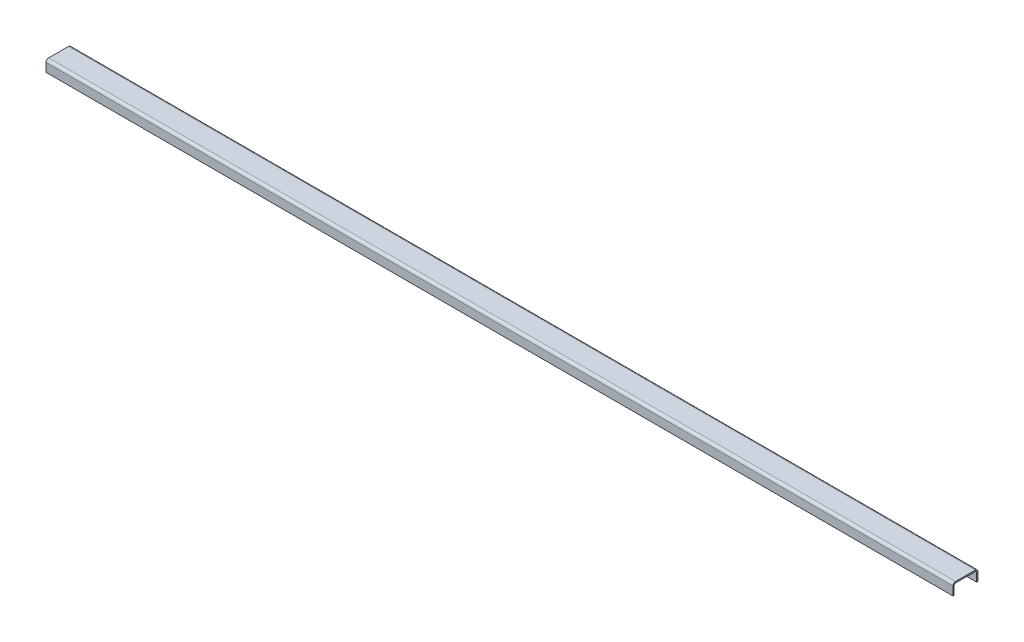
ISO-10303-21;
HEADER;
FILE_DESCRIPTION(('STEP AP214'),'2;1');
FILE_NAME('part.step','',(''),(''),'','','');
FILE_SCHEMA(('AUTOMOTIVE_DESIGN { 1 0 10303 214 1 1 1 1 }'));
ENDSEC;
DATA;
#1=APPLICATION_CONTEXT('core data for automotive mechanical design processes');
#2=APPLICATION_PROTOCOL_DEFINITION('international standard','automotive_design',2000,#1);
#3=PRODUCT_CONTEXT('',#1,'mechanical');
#4=PRODUCT('Part','Part','',(#3));
#5=PRODUCT_RELATED_PRODUCT_CATEGORY('part','',(#4));
#6=PRODUCT_DEFINITION_FORMATION('','',#4);
#7=PRODUCT_DEFINITION_CONTEXT('part definition',#1,'design');
#8=PRODUCT_DEFINITION('design','',#6,#7);
#9=PRODUCT_DEFINITION_SHAPE('','',#8);
#10=(LENGTH_UNIT() NAMED_UNIT(*) SI_UNIT(.MILLI.,.METRE.));
#11=(NAMED_UNIT(*) PLANE_ANGLE_UNIT() SI_UNIT($,.RADIAN.));
#12=(NAMED_UNIT(*) SI_UNIT($,.STERADIAN.) SOLID_ANGLE_UNIT());
#13=UNCERTAINTY_MEASURE_WITH_UNIT(LENGTH_MEASURE(1.E-05),#10,'distance_accuracy_value','');
#14=(GEOMETRIC_REPRESENTATION_CONTEXT(3) GLOBAL_UNCERTAINTY_ASSIGNED_CONTEXT((#13)) GLOBAL_UNIT_ASSIGNED_CONTEXT((#10,
#11,#12)) REPRESENTATION_CONTEXT('',''));
#15=CARTESIAN_POINT('',(0.,0.,0.));
#16=DIRECTION('',(0.,0.,1.));
#17=DIRECTION('',(1.,0.,0.));
#18=AXIS2_PLACEMENT_3D('',#15,#16,#17);
#19=CARTESIAN_POINT('',(0.,-4.123385067,0.));
#20=DIRECTION('',(0.,-1.,0.));
#21=DIRECTION('',(0.,0.,-1.));
#22=AXIS2_PLACEMENT_3D('',#19,#20,#21);
#23=PLANE('',#22);
#24=DIRECTION('',(0.,0.,-1.));
#25=VECTOR('',#24,1.);
#26=CARTESIAN_POINT('',(1057.5,-4.123385067,0.));
#27=LINE('',#26,#25);
#28=CARTESIAN_POINT('',(1057.5,-4.123385067,26.248385067));
#29=VERTEX_POINT('',#28);
#30=CARTESIAN_POINT('',(1057.5,-4.123385067,27.248385067));
#31=VERTEX_POINT('',#30);
#32=EDGE_CURVE('E200',#29,#31,#27,.F.);
#33=ORIENTED_EDGE('',*,*,#32,.T.);
#34=DIRECTION('',(1.,0.,0.));
#35=VECTOR('',#34,1.);
#36=CARTESIAN_POINT('',(0.,-4.123385067,27.248385067));
#37=LINE('',#36,#35);
#38=CARTESIAN_POINT('',(352.5,-4.123385067,27.248385067));
#39=VERTEX_POINT('',#38);
#40=EDGE_CURVE('E182',#39,#31,#37,.T.);
#41=ORIENTED_EDGE('',*,*,#40,.F.);
#42=DIRECTION('',(0.,0.,-1.));
#43=VECTOR('',#42,1.);
#44=CARTESIAN_POINT('',(352.5,-4.123385067,0.));
#45=LINE('',#44,#43);
#46=CARTESIAN_POINT('',(352.5,-4.123385067,26.248385067));
#47=VERTEX_POINT('',#46);
#48=EDGE_CURVE('E203',#39,#47,#45,.T.);
#49=ORIENTED_EDGE('',*,*,#48,.T.);
#50=DIRECTION('',(1.,0.,0.));
#51=VECTOR('',#50,1.);
#52=CARTESIAN_POINT('',(0.,-4.123385067,26.248385067));
#53=LINE('',#52,#51);
#54=EDGE_CURVE('E110',#29,#47,#53,.F.);
#55=ORIENTED_EDGE('',*,*,#54,.F.);
#56=EDGE_LOOP('',(#33,#41,#49,#55));
#57=FACE_BOUND('',#56,.T.);
#58=ADVANCED_FACE('F17',(#57),#23,.T.);
#59=CARTESIAN_POINT('',(352.5,2.58,25.248385067));
#60=DIRECTION('',(-1.,0.,0.));
#61=DIRECTION('',(0.,0.,1.));
#62=AXIS2_PLACEMENT_3D('',#59,#60,#61);
#63=CYLINDRICAL_SURFACE('',#62,1.000000000063);
#64=CARTESIAN_POINT('',(1057.5,2.58,25.248385067));
#65=DIRECTION('',(-1.,0.,0.));
#66=DIRECTION('',(0.,0.,1.));
#67=AXIS2_PLACEMENT_3D('',#64,#65,#66);
#68=CIRCLE('',#67,1.000000000063);
#69=CARTESIAN_POINT('',(1057.5,3.58,25.248385067));
#70=VERTEX_POINT('',#69);
#71=CARTESIAN_POINT('',(1057.5,2.58,26.248385067));
#72=VERTEX_POINT('',#71);
#73=EDGE_CURVE('E114',#70,#72,#68,.F.);
#74=ORIENTED_EDGE('',*,*,#73,.T.);
#75=DIRECTION('',(1.,0.,0.));
#76=VECTOR('',#75,1.);
#77=CARTESIAN_POINT('',(0.,2.58,26.248385067));
#78=LINE('',#77,#76);
#79=CARTESIAN_POINT('',(352.5,2.58,26.248385067));
#80=VERTEX_POINT('',#79);
#81=EDGE_CURVE('E179',#80,#72,#78,.T.);
#82=ORIENTED_EDGE('',*,*,#81,.F.);
#83=CARTESIAN_POINT('',(352.5,2.58,25.248385067));
#84=DIRECTION('',(-1.,0.,0.));
#85=DIRECTION('',(0.,0.,1.));
#86=AXIS2_PLACEMENT_3D('',#83,#84,#85);
#87=CIRCLE('',#86,1.000000000063);
#88=CARTESIAN_POINT('',(352.5,3.58,25.248385067));
#89=VERTEX_POINT('',#88);
#90=EDGE_CURVE('E20',#80,#89,#87,.T.);
#91=ORIENTED_EDGE('',*,*,#90,.T.);
#92=DIRECTION('',(1.,0.,0.));
#93=VECTOR('',#92,1.);
#94=CARTESIAN_POINT('',(0.,3.58,25.248385067));
#95=LINE('',#94,#93);
#96=EDGE_CURVE('E109',#70,#89,#95,.F.);
#97=ORIENTED_EDGE('',*,*,#96,.F.);
#98=EDGE_LOOP('',(#74,#82,#91,#97));
#99=FACE_BOUND('',#98,.T.);
#100=ADVANCED_FACE('F221',(#99),#63,.F.);
#101=CARTESIAN_POINT('',(352.5,2.58,9.751614933));
#102=DIRECTION('',(-1.,0.,0.));
#103=DIRECTION('',(0.,0.,1.));
#104=AXIS2_PLACEMENT_3D('',#101,#102,#103);
#105=CYLINDRICAL_SURFACE('',#104,1.);
#106=CARTESIAN_POINT('',(1057.5,2.58,9.751614933));
#107=DIRECTION('',(-1.,0.,0.));
#108=DIRECTION('',(0.,0.,1.));
#109=AXIS2_PLACEMENT_3D('',#106,#107,#108);
#110=CIRCLE('',#109,1.);
#111=CARTESIAN_POINT('',(1057.5,2.58,8.75161493302429));
#112=VERTEX_POINT('',#111);
#113=CARTESIAN_POINT('',(1057.5,3.58,9.751614933));
#114=VERTEX_POINT('',#113);
#115=EDGE_CURVE('E89',#112,#114,#110,.F.);
#116=ORIENTED_EDGE('',*,*,#115,.T.);
#117=DIRECTION('',(1.,0.,0.));
#118=VECTOR('',#117,1.);
#119=CARTESIAN_POINT('',(0.,3.58,9.751614933));
#120=LINE('',#119,#118);
#121=CARTESIAN_POINT('',(352.5,3.58,9.751614933));
#122=VERTEX_POINT('',#121);
#123=EDGE_CURVE('E92',#122,#114,#120,.T.);
#124=ORIENTED_EDGE('',*,*,#123,.F.);
#125=CARTESIAN_POINT('',(352.5,2.58,9.751614933));
#126=DIRECTION('',(-1.,0.,0.));
#127=DIRECTION('',(0.,0.,1.));
#128=AXIS2_PLACEMENT_3D('',#125,#126,#127);
#129=CIRCLE('',#128,1.);
#130=CARTESIAN_POINT('',(352.5,2.58,8.75161493302429));
#131=VERTEX_POINT('',#130);
#132=EDGE_CURVE('E100',#122,#131,#129,.T.);
#133=ORIENTED_EDGE('',*,*,#132,.T.);
#134=DIRECTION('',(1.,0.,0.));
#135=VECTOR('',#134,1.);
#136=CARTESIAN_POINT('',(0.,2.58,8.75161493304859));
#137=LINE('',#136,#135);
#138=EDGE_CURVE('E95',#112,#131,#137,.F.);
#139=ORIENTED_EDGE('',*,*,#138,.F.);
#140=EDGE_LOOP('',(#116,#124,#133,#139));
#141=FACE_BOUND('',#140,.T.);
#142=ADVANCED_FACE('F91',(#141),#105,.F.);
#143=CARTESIAN_POINT('',(0.,-4.123385067,0.));
#144=DIRECTION('',(0.,-1.,0.));
#145=DIRECTION('',(0.,0.,-1.));
#146=AXIS2_PLACEMENT_3D('',#143,#144,#145);
#147=PLANE('',#146);
#148=DIRECTION('',(0.,0.,-1.));
#149=VECTOR('',#148,1.);
#150=CARTESIAN_POINT('',(1057.5,-4.123385067,0.));
#151=LINE('',#150,#149);
#152=CARTESIAN_POINT('',(1057.5,-4.123385067,7.751614933));
#153=VERTEX_POINT('',#152);
#154=CARTESIAN_POINT('',(1057.5,-4.123385067,8.75161493297412));
#155=VERTEX_POINT('',#154);
#156=EDGE_CURVE('E189',#153,#155,#151,.F.);
#157=ORIENTED_EDGE('',*,*,#156,.T.);
#158=DIRECTION('',(1.,0.,0.));
#159=VECTOR('',#158,1.);
#160=CARTESIAN_POINT('',(0.,-4.123385067,8.75161493292235));
#161=LINE('',#160,#159);
#162=CARTESIAN_POINT('',(352.5,-4.123385067,8.75161493297412));
#163=VERTEX_POINT('',#162);
#164=EDGE_CURVE('E173',#163,#155,#161,.T.);
#165=ORIENTED_EDGE('',*,*,#164,.F.);
#166=DIRECTION('',(0.,0.,-1.));
#167=VECTOR('',#166,1.);
#168=CARTESIAN_POINT('',(352.5,-4.123385067,0.));
#169=LINE('',#168,#167);
#170=CARTESIAN_POINT('',(352.5,-4.123385067,7.751614933));
#171=VERTEX_POINT('',#170);
#172=EDGE_CURVE('E99',#163,#171,#169,.T.);
#173=ORIENTED_EDGE('',*,*,#172,.T.);
#174=DIRECTION('',(1.,0.,0.));
#175=VECTOR('',#174,1.);
#176=CARTESIAN_POINT('',(0.,-4.123385067,7.75161493300001));
#177=LINE('',#176,#175);
#178=EDGE_CURVE('E167',#153,#171,#177,.F.);
#179=ORIENTED_EDGE('',*,*,#178,.F.);
#180=EDGE_LOOP('',(#157,#165,#173,#179));
#181=FACE_BOUND('',#180,.T.);
#182=ADVANCED_FACE('F264',(#181),#147,.T.);
#183=CARTESIAN_POINT('',(0.,0.,27.248385067));
#184=DIRECTION('',(0.,0.,1.));
#185=DIRECTION('',(0.,-1.,0.));
#186=AXIS2_PLACEMENT_3D('',#183,#184,#185);
#187=PLANE('',#186);
#188=DIRECTION('',(0.,1.,0.));
#189=VECTOR('',#188,1.);
#190=CARTESIAN_POINT('',(1057.5,0.,27.248385067));
#191=LINE('',#190,#189);
#192=CARTESIAN_POINT('',(1057.5,2.58,27.248385067));
#193=VERTEX_POINT('',#192);
#194=EDGE_CURVE('E121',#193,#31,#191,.F.);
#195=ORIENTED_EDGE('',*,*,#194,.F.);
#196=DIRECTION('',(1.,0.,0.));
#197=VECTOR('',#196,1.);
#198=CARTESIAN_POINT('',(352.5,2.58,27.248385067));
#199=LINE('',#198,#197);
#200=CARTESIAN_POINT('',(352.5,2.58,27.248385067));
#201=VERTEX_POINT('',#200);
#202=EDGE_CURVE('E130',#201,#193,#199,.T.);
#203=ORIENTED_EDGE('',*,*,#202,.F.);
#204=DIRECTION('',(0.,1.,0.));
#205=VECTOR('',#204,1.);
#206=CARTESIAN_POINT('',(352.5,0.,27.248385067));
#207=LINE('',#206,#205);
#208=EDGE_CURVE('E156',#39,#201,#207,.T.);
#209=ORIENTED_EDGE('',*,*,#208,.F.);
#210=ORIENTED_EDGE('',*,*,#40,.T.);
#211=EDGE_LOOP('',(#195,#203,#209,#210));
#212=FACE_BOUND('',#211,.T.);
#213=ADVANCED_FACE('F250',(#212),#187,.T.);
#214=CARTESIAN_POINT('',(0.,0.,26.248385067));
#215=DIRECTION('',(0.,0.,-1.));
#216=DIRECTION('',(0.,1.,0.));
#217=AXIS2_PLACEMENT_3D('',#214,#215,#216);
#218=PLANE('',#217);
#219=DIRECTION('',(0.,1.,0.));
#220=VECTOR('',#219,1.);
#221=CARTESIAN_POINT('',(1057.5,0.,26.248385067));
#222=LINE('',#221,#220);
#223=EDGE_CURVE('E117',#29,#72,#222,.T.);
#224=ORIENTED_EDGE('',*,*,#223,.F.);
#225=ORIENTED_EDGE('',*,*,#54,.T.);
#226=DIRECTION('',(0.,1.,0.));
#227=VECTOR('',#226,1.);
#228=CARTESIAN_POINT('',(352.5,0.,26.248385067));
#229=LINE('',#228,#227);
#230=EDGE_CURVE('E141',#80,#47,#229,.F.);
#231=ORIENTED_EDGE('',*,*,#230,.F.);
#232=ORIENTED_EDGE('',*,*,#81,.T.);
#233=EDGE_LOOP('',(#224,#225,#231,#232));
#234=FACE_BOUND('',#233,.T.);
#235=ADVANCED_FACE('F248',(#234),#218,.T.);
#236=CARTESIAN_POINT('',(0.,3.58,0.));
#237=DIRECTION('',(0.,-1.,0.));
#238=DIRECTION('',(0.,0.,-1.));
#239=AXIS2_PLACEMENT_3D('',#236,#237,#238);
#240=PLANE('',#239);
#241=DIRECTION('',(0.,0.,-1.));
#242=VECTOR('',#241,1.);
#243=CARTESIAN_POINT('',(1057.5,3.58,0.));
#244=LINE('',#243,#242);
#245=EDGE_CURVE('E106',#70,#114,#244,.T.);
#246=ORIENTED_EDGE('',*,*,#245,.F.);
#247=ORIENTED_EDGE('',*,*,#96,.T.);
#248=DIRECTION('',(0.,0.,1.));
#249=VECTOR('',#248,1.);
#250=CARTESIAN_POINT('',(352.5,3.58,0.));
#251=LINE('',#250,#249);
#252=EDGE_CURVE('E108',#122,#89,#251,.T.);
#253=ORIENTED_EDGE('',*,*,#252,.F.);
#254=ORIENTED_EDGE('',*,*,#123,.T.);
#255=EDGE_LOOP('',(#246,#247,#253,#254));
#256=FACE_BOUND('',#255,.T.);
#257=ADVANCED_FACE('F104',(#256),#240,.T.);
#258=CARTESIAN_POINT('',(0.,0.,8.751614933));
#259=DIRECTION('',(0.,-1.8832E-11,1.));
#260=DIRECTION('',(0.,-1.,-1.8832E-11));
#261=AXIS2_PLACEMENT_3D('',#258,#259,#260);
#262=PLANE('',#261);
#263=DIRECTION('',(0.,1.,0.));
#264=VECTOR('',#263,1.);
#265=CARTESIAN_POINT('',(1057.5,0.,8.751614933));
#266=LINE('',#265,#264);
#267=EDGE_CURVE('E116',#112,#155,#266,.F.);
#268=ORIENTED_EDGE('',*,*,#267,.F.);
#269=ORIENTED_EDGE('',*,*,#138,.T.);
#270=DIRECTION('',(0.,1.,0.));
#271=VECTOR('',#270,1.);
#272=CARTESIAN_POINT('',(352.5,0.,8.751614933));
#273=LINE('',#272,#271);
#274=EDGE_CURVE('E148',#163,#131,#273,.T.);
#275=ORIENTED_EDGE('',*,*,#274,.F.);
#276=ORIENTED_EDGE('',*,*,#164,.T.);
#277=EDGE_LOOP('',(#268,#269,#275,#276));
#278=FACE_BOUND('',#277,.T.);
#279=ADVANCED_FACE('F229',(#278),#262,.T.);
#280=CARTESIAN_POINT('',(0.,0.,7.751614933));
#281=DIRECTION('',(0.,0.,-1.));
#282=DIRECTION('',(0.,1.,0.));
#283=AXIS2_PLACEMENT_3D('',#280,#281,#282);
#284=PLANE('',#283);
#285=DIRECTION('',(0.,1.,0.));
#286=VECTOR('',#285,1.);
#287=CARTESIAN_POINT('',(1057.5,0.,7.751614933));
#288=LINE('',#287,#286);
#289=CARTESIAN_POINT('',(1057.5,2.579999999,7.7516149329685));
#290=VERTEX_POINT('',#289);
#291=EDGE_CURVE('E119',#153,#290,#288,.T.);
#292=ORIENTED_EDGE('',*,*,#291,.F.);
#293=ORIENTED_EDGE('',*,*,#178,.T.);
#294=DIRECTION('',(0.,1.,0.));
#295=VECTOR('',#294,1.);
#296=CARTESIAN_POINT('',(352.5,0.,7.751614933));
#297=LINE('',#296,#295);
#298=CARTESIAN_POINT('',(352.5,2.579999999,7.7516149329685));
#299=VERTEX_POINT('',#298);
#300=EDGE_CURVE('E151',#299,#171,#297,.F.);
#301=ORIENTED_EDGE('',*,*,#300,.F.);
#302=DIRECTION('',(1.,0.,0.));
#303=VECTOR('',#302,1.);
#304=CARTESIAN_POINT('',(352.5,2.579999999,7.751614932937));
#305=LINE('',#304,#303);
#306=EDGE_CURVE('E160',#290,#299,#305,.F.);
#307=ORIENTED_EDGE('',*,*,#306,.F.);
#308=EDGE_LOOP('',(#292,#293,#301,#307));
#309=FACE_BOUND('',#308,.T.);
#310=ADVANCED_FACE('F263',(#309),#284,.T.);
#311=CARTESIAN_POINT('',(352.5,0.,0.));
#312=DIRECTION('',(-1.,0.,0.));
#313=DIRECTION('',(0.,0.,1.));
#314=AXIS2_PLACEMENT_3D('',#311,#312,#313);
#315=PLANE('',#314);
#316=ORIENTED_EDGE('',*,*,#230,.T.);
#317=ORIENTED_EDGE('',*,*,#48,.F.);
#318=ORIENTED_EDGE('',*,*,#208,.T.);
#319=CARTESIAN_POINT('',(352.5,2.58,25.248385067));
#320=DIRECTION('',(1.,0.,0.));
#321=DIRECTION('',(0.,0.,-1.));
#322=AXIS2_PLACEMENT_3D('',#319,#320,#321);
#323=CIRCLE('',#322,2.);
#324=CARTESIAN_POINT('',(352.5,4.58,25.248385067));
#325=VERTEX_POINT('',#324);
#326=EDGE_CURVE('E144',#325,#201,#323,.T.);
#327=ORIENTED_EDGE('',*,*,#326,.F.);
#328=DIRECTION('',(0.,0.,1.));
#329=VECTOR('',#328,1.);
#330=CARTESIAN_POINT('',(352.5,4.58,0.));
#331=LINE('',#330,#329);
#332=CARTESIAN_POINT('',(352.5,4.58,9.7516149335));
#333=VERTEX_POINT('',#332);
#334=EDGE_CURVE('E136',#333,#325,#331,.T.);
#335=ORIENTED_EDGE('',*,*,#334,.F.);
#336=CARTESIAN_POINT('',(352.5,2.58,9.751614934));
#337=DIRECTION('',(1.,0.,0.));
#338=DIRECTION('',(0.,0.,-1.));
#339=AXIS2_PLACEMENT_3D('',#336,#337,#338);
#340=CIRCLE('',#339,2.);
#341=EDGE_CURVE('E211',#299,#333,#340,.T.);
#342=ORIENTED_EDGE('',*,*,#341,.F.);
#343=ORIENTED_EDGE('',*,*,#300,.T.);
#344=ORIENTED_EDGE('',*,*,#172,.F.);
#345=ORIENTED_EDGE('',*,*,#274,.T.);
#346=ORIENTED_EDGE('',*,*,#132,.F.);
#347=ORIENTED_EDGE('',*,*,#252,.T.);
#348=ORIENTED_EDGE('',*,*,#90,.F.);
#349=EDGE_LOOP('',(#316,#317,#318,#327,#335,#342,#343,#344,#345,#346,#347,#348));
#350=FACE_BOUND('',#349,.T.);
#351=ADVANCED_FACE('F225',(#350),#315,.T.);
#352=CARTESIAN_POINT('',(352.5,2.58,25.248385067));
#353=DIRECTION('',(1.,0.,0.));
#354=DIRECTION('',(0.,0.,-1.));
#355=AXIS2_PLACEMENT_3D('',#352,#353,#354);
#356=CYLINDRICAL_SURFACE('',#355,2.);
#357=CARTESIAN_POINT('',(1057.5,2.58,25.248385067));
#358=DIRECTION('',(1.,0.,0.));
#359=DIRECTION('',(0.,0.,-1.));
#360=AXIS2_PLACEMENT_3D('',#357,#358,#359);
#361=CIRCLE('',#360,2.);
#362=CARTESIAN_POINT('',(1057.5,4.58,25.248385067));
#363=VERTEX_POINT('',#362);
#364=EDGE_CURVE('E214',#363,#193,#361,.T.);
#365=ORIENTED_EDGE('',*,*,#364,.F.);
#366=DIRECTION('',(1.,0.,0.));
#367=VECTOR('',#366,1.);
#368=CARTESIAN_POINT('',(0.,4.58,25.248385067));
#369=LINE('',#368,#367);
#370=EDGE_CURVE('E133',#325,#363,#369,.T.);
#371=ORIENTED_EDGE('',*,*,#370,.F.);
#372=ORIENTED_EDGE('',*,*,#326,.T.);
#373=ORIENTED_EDGE('',*,*,#202,.T.);
#374=EDGE_LOOP('',(#365,#371,#372,#373));
#375=FACE_BOUND('',#374,.T.);
#376=ADVANCED_FACE('F254',(#375),#356,.T.);
#377=CARTESIAN_POINT('',(1057.5,0.,0.));
#378=DIRECTION('',(1.,0.,0.));
#379=DIRECTION('',(0.,0.,-1.));
#380=AXIS2_PLACEMENT_3D('',#377,#378,#379);
#381=PLANE('',#380);
#382=DIRECTION('',(0.,0.,1.));
#383=VECTOR('',#382,1.);
#384=CARTESIAN_POINT('',(1057.5,4.58,0.));
#385=LINE('',#384,#383);
#386=CARTESIAN_POINT('',(1057.5,4.58,9.7516149335));
#387=VERTEX_POINT('',#386);
#388=EDGE_CURVE('E26',#363,#387,#385,.F.);
#389=ORIENTED_EDGE('',*,*,#388,.F.);
#390=ORIENTED_EDGE('',*,*,#364,.T.);
#391=ORIENTED_EDGE('',*,*,#194,.T.);
#392=ORIENTED_EDGE('',*,*,#32,.F.);
#393=ORIENTED_EDGE('',*,*,#223,.T.);
#394=ORIENTED_EDGE('',*,*,#73,.F.);
#395=ORIENTED_EDGE('',*,*,#245,.T.);
#396=ORIENTED_EDGE('',*,*,#115,.F.);
#397=ORIENTED_EDGE('',*,*,#267,.T.);
#398=ORIENTED_EDGE('',*,*,#156,.F.);
#399=ORIENTED_EDGE('',*,*,#291,.T.);
#400=CARTESIAN_POINT('',(1057.5,2.58,9.751614934));
#401=DIRECTION('',(1.,0.,0.));
#402=DIRECTION('',(0.,0.,-1.));
#403=AXIS2_PLACEMENT_3D('',#400,#401,#402);
#404=CIRCLE('',#403,2.);
#405=EDGE_CURVE('E35',#387,#290,#404,.F.);
#406=ORIENTED_EDGE('',*,*,#405,.F.);
#407=EDGE_LOOP('',(#389,#390,#391,#392,#393,#394,#395,#396,#397,#398,#399,#406));
#408=FACE_BOUND('',#407,.T.);
#409=ADVANCED_FACE('F112',(#408),#381,.T.);
#410=CARTESIAN_POINT('',(352.5,2.58,9.751614934));
#411=DIRECTION('',(1.,0.,0.));
#412=DIRECTION('',(0.,0.,-1.));
#413=AXIS2_PLACEMENT_3D('',#410,#411,#412);
#414=CYLINDRICAL_SURFACE('',#413,2.);
#415=ORIENTED_EDGE('',*,*,#405,.T.);
#416=ORIENTED_EDGE('',*,*,#306,.T.);
#417=ORIENTED_EDGE('',*,*,#341,.T.);
#418=DIRECTION('',(1.,0.,0.));
#419=VECTOR('',#418,1.);
#420=CARTESIAN_POINT('',(0.,4.58,9.751614933));
#421=LINE('',#420,#419);
#422=EDGE_CURVE('E11',#387,#333,#421,.F.);
#423=ORIENTED_EDGE('',*,*,#422,.F.);
#424=EDGE_LOOP('',(#415,#416,#417,#423));
#425=FACE_BOUND('',#424,.T.);
#426=ADVANCED_FACE('F258',(#425),#414,.T.);
#427=CARTESIAN_POINT('',(0.,4.58,0.));
#428=DIRECTION('',(0.,1.,0.));
#429=DIRECTION('',(0.,0.,1.));
#430=AXIS2_PLACEMENT_3D('',#427,#428,#429);
#431=PLANE('',#430);
#432=ORIENTED_EDGE('',*,*,#388,.T.);
#433=ORIENTED_EDGE('',*,*,#422,.T.);
#434=ORIENTED_EDGE('',*,*,#334,.T.);
#435=ORIENTED_EDGE('',*,*,#370,.T.);
#436=EDGE_LOOP('',(#432,#433,#434,#435));
#437=FACE_BOUND('',#436,.T.);
#438=ADVANCED_FACE('F256',(#437),#431,.T.);
#439=CLOSED_SHELL('',(#58,#100,#142,#182,#213,#235,#257,#279,#310,#351,#376,#409,#426,#438));
#440=MANIFOLD_SOLID_BREP('B1',#439);
#441=ADVANCED_BREP_SHAPE_REPRESENTATION('',(#18,#440),#14);
#442=SHAPE_DEFINITION_REPRESENTATION(#9,#441);
ENDSEC;
END-ISO-10303-21;
